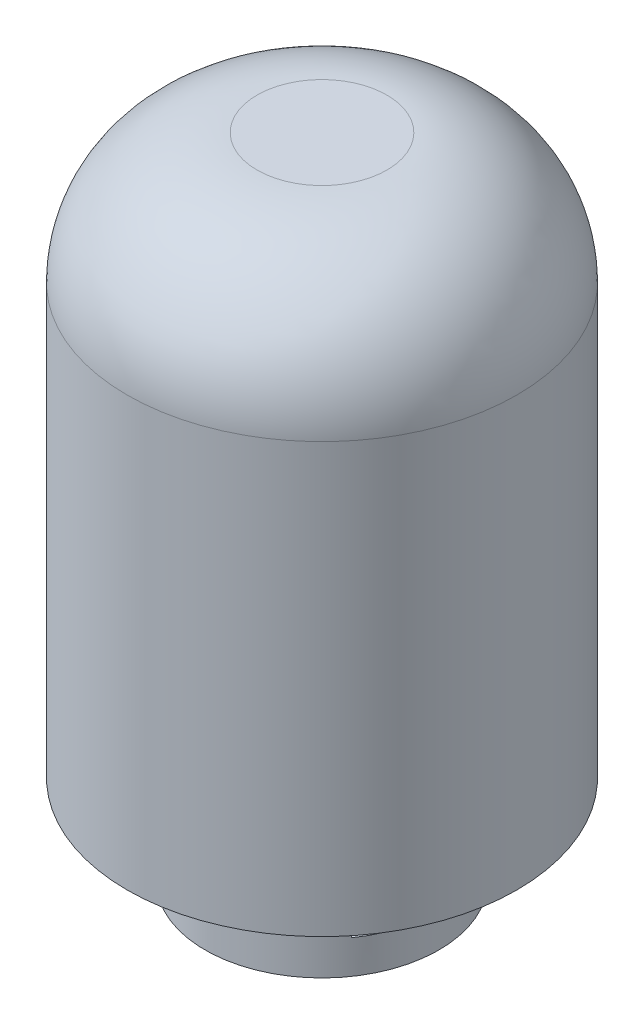
ISO-10303-21;
HEADER;
FILE_DESCRIPTION(('STEP AP214'),'2;1');
FILE_NAME('part.step','',(''),(''),'','','');
FILE_SCHEMA(('AUTOMOTIVE_DESIGN { 1 0 10303 214 1 1 1 1 }'));
ENDSEC;
DATA;
#1=APPLICATION_CONTEXT('core data for automotive mechanical design processes');
#2=APPLICATION_PROTOCOL_DEFINITION('international standard','automotive_design',2000,#1);
#3=PRODUCT_CONTEXT('',#1,'mechanical');
#4=PRODUCT('Part','Part','',(#3));
#5=PRODUCT_RELATED_PRODUCT_CATEGORY('part','',(#4));
#6=PRODUCT_DEFINITION_FORMATION('','',#4);
#7=PRODUCT_DEFINITION_CONTEXT('part definition',#1,'design');
#8=PRODUCT_DEFINITION('design','',#6,#7);
#9=PRODUCT_DEFINITION_SHAPE('','',#8);
#10=(LENGTH_UNIT() NAMED_UNIT(*) SI_UNIT(.MILLI.,.METRE.));
#11=(NAMED_UNIT(*) PLANE_ANGLE_UNIT() SI_UNIT($,.RADIAN.));
#12=(NAMED_UNIT(*) SI_UNIT($,.STERADIAN.) SOLID_ANGLE_UNIT());
#13=UNCERTAINTY_MEASURE_WITH_UNIT(LENGTH_MEASURE(1.E-05),#10,'distance_accuracy_value','');
#14=(GEOMETRIC_REPRESENTATION_CONTEXT(3) GLOBAL_UNCERTAINTY_ASSIGNED_CONTEXT((#13)) GLOBAL_UNIT_ASSIGNED_CONTEXT((#10,
#11,#12)) REPRESENTATION_CONTEXT('',''));
#15=CARTESIAN_POINT('',(0.,0.,0.));
#16=DIRECTION('',(0.,0.,1.));
#17=DIRECTION('',(1.,0.,0.));
#18=AXIS2_PLACEMENT_3D('',#15,#16,#17);
#19=CARTESIAN_POINT('',(0.,500.,0.));
#20=DIRECTION('',(0.,-1.,0.));
#21=DIRECTION('',(0.,0.,-1.));
#22=AXIS2_PLACEMENT_3D('',#19,#20,#21);
#23=CYLINDRICAL_SURFACE('',#22,150.);
#24=CARTESIAN_POINT('',(0.,316.930268713618,-150.));
#25=CARTESIAN_POINT('',(-0.897963726607649,316.930269795766,-150.000000723878));
#26=CARTESIAN_POINT('',(-1.79589933013839,316.912346694936,-149.991932593616));
#27=CARTESIAN_POINT('',(-3.59014286209545,316.840705533896,-149.959714425526));
#28=CARTESIAN_POINT('',(-4.48645064598536,316.786984437349,-149.935563023536));
#29=CARTESIAN_POINT('',(-6.27605289240073,316.643863674608,-149.871322350685));
#30=CARTESIAN_POINT('',(-7.16934576597934,316.554447485565,-149.831225698983));
#31=CARTESIAN_POINT('',(-8.95091468337228,316.340179646689,-149.735356554535));
#32=CARTESIAN_POINT('',(-9.83919021709062,316.215324457747,-149.679582496174));
#33=CARTESIAN_POINT('',(-11.6107680615418,315.930243235637,-149.552600420344));
#34=CARTESIAN_POINT('',(-12.4940568506258,315.769946869837,-149.481361718636));
#35=CARTESIAN_POINT('',(-14.2523487360671,315.414548283156,-149.323975898032));
#36=CARTESIAN_POINT('',(-15.1273509935033,315.219442577051,-149.237827286333));
#37=CARTESIAN_POINT('',(-16.8672537600114,314.794994017387,-149.051202459609));
#38=CARTESIAN_POINT('',(-17.7321566441733,314.565659395778,-148.95072968976));
#39=CARTESIAN_POINT('',(-19.450627125798,314.073306867624,-148.73608659745));
#40=CARTESIAN_POINT('',(-20.304193614517,313.810285692791,-148.621914945986));
#41=CARTESIAN_POINT('',(-22.8394744264702,312.973690049115,-148.260792899483));
#42=CARTESIAN_POINT('',(-24.5025345815619,312.350928334996,-147.994501252408));
#43=CARTESIAN_POINT('',(-27.7676202835299,310.979809985764,-147.416789849528));
#44=CARTESIAN_POINT('',(-29.3696439845671,310.231449556041,-147.105368730301));
#45=CARTESIAN_POINT('',(-32.5035395811796,308.615375237574,-146.444812937237));
#46=CARTESIAN_POINT('',(-34.0354331399172,307.747698541697,-146.095690022931));
#47=CARTESIAN_POINT('',(-37.0217568867908,305.899056462126,-145.36764514214));
#48=CARTESIAN_POINT('',(-38.4761848231274,304.918087787841,-144.988722310213));
#49=CARTESIAN_POINT('',(-41.3738503297023,302.795470226522,-144.189384794203));
#50=CARTESIAN_POINT('',(-42.8126094199402,301.64813165143,-143.767837625223));
#51=CARTESIAN_POINT('',(-45.5895556378162,299.242093676546,-142.911525449857));
#52=CARTESIAN_POINT('',(-46.9277396126281,297.9833907884,-142.476760029705));
#53=CARTESIAN_POINT('',(-49.4974997484848,295.360865951971,-141.60451921085));
#54=CARTESIAN_POINT('',(-50.7290144471632,293.996984244401,-141.167042403369));
#55=CARTESIAN_POINT('',(-53.0780430901764,291.171691880393,-140.30070851219));
#56=CARTESIAN_POINT('',(-54.1955533659693,289.710278087979,-139.87185170623));
#57=CARTESIAN_POINT('',(-56.3730859151129,286.607267425215,-139.009091790173));
#58=CARTESIAN_POINT('',(-57.4256982482058,284.960122385466,-138.576414691045));
#59=CARTESIAN_POINT('',(-59.387668496699,281.573432925948,-137.747014192213));
#60=CARTESIAN_POINT('',(-60.297019198132,279.833883859051,-137.350292603484));
#61=CARTESIAN_POINT('',(-61.54699999149,277.164413684057,-136.792450952378));
#62=CARTESIAN_POINT('',(-61.9446269710591,276.264636134097,-136.612722699818));
#63=CARTESIAN_POINT('',(-62.7010156148413,274.446299405818,-136.267221202872));
#64=CARTESIAN_POINT('',(-63.0597817740851,273.527742414358,-136.101446344992));
#65=CARTESIAN_POINT('',(-63.7374940943656,271.673390955956,-135.785388262023));
#66=CARTESIAN_POINT('',(-64.056438260829,270.737595628285,-135.63510581297));
#67=CARTESIAN_POINT('',(-64.6535195975648,268.850656541203,-135.351511472993));
#68=CARTESIAN_POINT('',(-64.9316620246984,267.899514776573,-135.218197396171));
#69=CARTESIAN_POINT('',(-65.4325886341979,266.034729903674,-134.976477575309));
#70=CARTESIAN_POINT('',(-65.657532990471,265.121789588703,-134.867123051159));
#71=CARTESIAN_POINT('',(-66.0693994136154,263.285579807978,-134.665834635669));
#72=CARTESIAN_POINT('',(-66.2563262152956,262.36231164361,-134.573898575084));
#73=CARTESIAN_POINT('',(-66.591613425137,260.507076928613,-134.408303315077));
#74=CARTESIAN_POINT('',(-66.7399701869683,259.575109564201,-134.334645843703));
#75=CARTESIAN_POINT('',(-66.997588166978,257.704588689166,-134.206348206611));
#76=CARTESIAN_POINT('',(-67.1068538224223,256.766035938395,-134.151705882485));
#77=CARTESIAN_POINT('',(-67.2858956350638,254.884688878571,-134.061994165164));
#78=CARTESIAN_POINT('',(-67.3556905933009,253.941896804908,-134.026915453362));
#79=CARTESIAN_POINT('',(-67.45562079938,252.053787474251,-133.976648553898));
#80=CARTESIAN_POINT('',(-67.4857604944271,251.108470512332,-133.961458135832));
#81=CARTESIAN_POINT('',(-67.5062877948071,249.217296820774,-133.951115101553));
#82=CARTESIAN_POINT('',(-67.4966753965906,248.271440091087,-133.95596248713));
#83=CARTESIAN_POINT('',(-67.4377322987871,246.381292694904,-133.985646114263));
#84=CARTESIAN_POINT('',(-67.3884024041979,245.437001997056,-134.010481950691));
#85=CARTESIAN_POINT('',(-67.2565926269489,243.639214447865,-134.076678087868));
#86=CARTESIAN_POINT('',(-67.1775994455162,242.785395278314,-134.116298249048));
#87=CARTESIAN_POINT('',(-66.9872672677983,241.082192478983,-134.211465017823));
#88=CARTESIAN_POINT('',(-66.8759256633904,240.232809212475,-134.267012909602));
#89=CARTESIAN_POINT('',(-66.6212252766361,238.540152678016,-134.39357350199));
#90=CARTESIAN_POINT('',(-66.4778718117158,237.696878419301,-134.464583634149));
#91=CARTESIAN_POINT('',(-66.1595305716245,236.017695334586,-134.621498296829));
#92=CARTESIAN_POINT('',(-65.984539820215,235.181787209313,-134.707404228624));
#93=CARTESIAN_POINT('',(-65.4127232296089,232.687051614057,-134.98650694043));
#94=CARTESIAN_POINT('',(-64.9690298856048,231.041059436436,-135.201100302112));
#95=CARTESIAN_POINT('',(-63.9611056062285,227.794233929143,-135.680829996122));
#96=CARTESIAN_POINT('',(-63.3968692943984,226.193402617344,-135.945968582812));
#97=CARTESIAN_POINT('',(-62.1385984318635,223.009831383483,-136.525766781468));
#98=CARTESIAN_POINT('',(-61.4419230989972,221.428314095816,-136.841408537975));
#99=CARTESIAN_POINT('',(-59.9329875859232,218.329507182064,-137.508971553331));
#100=CARTESIAN_POINT('',(-59.1207270253488,216.81221776736,-137.860892931567));
#101=CARTESIAN_POINT('',(-57.3857874417233,213.848377672659,-138.592054397057));
#102=CARTESIAN_POINT('',(-56.4630713256356,212.401850987122,-138.971303644406));
#103=CARTESIAN_POINT('',(-54.5128110025768,209.586366704599,-139.747826559225));
#104=CARTESIAN_POINT('',(-53.4852608450594,208.217413517675,-140.145101249137));
#105=CARTESIAN_POINT('',(-51.2226006070111,205.429902868654,-140.988811563049));
#106=CARTESIAN_POINT('',(-49.9770096586735,204.020120531546,-141.436184305927));
#107=CARTESIAN_POINT('',(-47.372330446627,201.309106731108,-142.329750896053));
#108=CARTESIAN_POINT('',(-46.0132352522987,200.007881906059,-142.775944669593));
#109=CARTESIAN_POINT('',(-43.1883420633296,197.521127334777,-143.655685225522));
#110=CARTESIAN_POINT('',(-41.7225103469433,196.335634431558,-144.089227949881));
#111=CARTESIAN_POINT('',(-38.6922863238986,194.088467807184,-144.932329163749));
#112=CARTESIAN_POINT('',(-37.127894055851,193.026794037524,-145.341887662654));
#113=CARTESIAN_POINT('',(-33.859013338828,191.004032883705,-146.138577524254));
#114=CARTESIAN_POINT('',(-32.1516809665461,190.047100706363,-146.524615242675));
#115=CARTESIAN_POINT('',(-28.6520480813877,188.281671057826,-147.248948125169));
#116=CARTESIAN_POINT('',(-26.8597447778378,187.473178466041,-147.587241719745));
#117=CARTESIAN_POINT('',(-23.2036262725102,186.013283170314,-148.206028792824));
#118=CARTESIAN_POINT('',(-21.339848871442,185.361798721683,-148.486552337598));
#119=CARTESIAN_POINT('',(-17.5542987287785,184.222889133297,-148.981505246283));
#120=CARTESIAN_POINT('',(-15.6325312539636,183.735449143256,-149.195940592747));
#121=CARTESIAN_POINT('',(-11.8856744291759,182.959403315176,-149.539339479824));
#122=CARTESIAN_POINT('',(-10.0634600965339,182.659099691548,-149.673306572311));
#123=CARTESIAN_POINT('',(-6.39692403183182,182.208692579835,-149.874779307781));
#124=CARTESIAN_POINT('',(-4.55260334888919,182.058581992263,-149.942288092184));
#125=CARTESIAN_POINT('',(-0.857191692920272,181.910391140358,-150.008931471916));
#126=CARTESIAN_POINT('',(0.993897079150536,181.912265205611,-150.008086607077));
#127=CARTESIAN_POINT('',(4.688344755231,182.067909945448,-149.938095445234));
#128=CARTESIAN_POINT('',(6.53170388620982,182.221676128139,-149.868951168044));
#129=CARTESIAN_POINT('',(10.0858923974315,182.665477066777,-149.670474398395));
#130=CARTESIAN_POINT('',(11.7980376313632,182.946782431901,-149.545001993502));
#131=CARTESIAN_POINT('',(15.190747005562,183.639020053861,-149.238540899741));
#132=CARTESIAN_POINT('',(16.8713127157462,184.049945848699,-149.057554978414));
#133=CARTESIAN_POINT('',(20.1902271040427,184.997486436991,-148.644380297984));
#134=CARTESIAN_POINT('',(21.8285729718467,185.534109573459,-148.412188140186));
#135=CARTESIAN_POINT('',(25.0532255016204,186.728256571894,-147.901998108013));
#136=CARTESIAN_POINT('',(26.6395301284072,187.385785155499,-147.623998444792));
#137=CARTESIAN_POINT('',(29.7997349840163,188.838655665072,-147.01919557636));
#138=CARTESIAN_POINT('',(31.3717183577973,189.637644813959,-146.69114437676));
#139=CARTESIAN_POINT('',(34.4426941044446,191.352357226966,-146.000610054867));
#140=CARTESIAN_POINT('',(35.941685585249,192.268081917262,-145.638126511924));
#141=CARTESIAN_POINT('',(38.8597822656825,194.210337679035,-144.886812879368));
#142=CARTESIAN_POINT('',(40.2788588908397,195.236908006661,-144.497973474056));
#143=CARTESIAN_POINT('',(43.0301890112443,197.394619552272,-143.702655494068));
#144=CARTESIAN_POINT('',(44.3624383388561,198.525765783517,-143.296176074245));
#145=CARTESIAN_POINT('',(46.3438420615755,200.344719435953,-142.663178975406));
#146=CARTESIAN_POINT('',(47.0260529765748,200.997923936694,-142.439626362712));
#147=CARTESIAN_POINT('',(48.3623048653516,202.332193266187,-141.991492167319));
#148=CARTESIAN_POINT('',(49.0163473852867,203.013256561763,-141.766910641848));
#149=CARTESIAN_POINT('',(50.2953320548644,204.402268279881,-141.318218474421));
#150=CARTESIAN_POINT('',(50.9202755863116,205.110215422902,-141.094107810591));
#151=CARTESIAN_POINT('',(52.1403353401983,206.552211499605,-140.647813946795));
#152=CARTESIAN_POINT('',(52.7354437453452,207.286267188918,-140.425631264473));
#153=CARTESIAN_POINT('',(54.4747477244499,209.526308353528,-139.764231450442));
#154=CARTESIAN_POINT('',(55.5728269528783,211.070064647618,-139.33019627561));
#155=CARTESIAN_POINT('',(57.638194031278,214.249567646676,-138.488566100045));
#156=CARTESIAN_POINT('',(58.6054876410052,215.8853102961,-138.080969935358));
#157=CARTESIAN_POINT('',(59.9643280513966,218.422490332448,-137.493749572727));
#158=CARTESIAN_POINT('',(60.4068739286565,219.293639536966,-137.299761850171));
#159=CARTESIAN_POINT('',(61.2545675561857,221.056269317313,-136.923675616138));
#160=CARTESIAN_POINT('',(61.6597242331188,221.947744976489,-136.741574269846));
#161=CARTESIAN_POINT('',(62.4317773214276,223.74984255163,-136.390809826209));
#162=CARTESIAN_POINT('',(62.798668666685,224.660466983657,-136.222148508945));
#163=CARTESIAN_POINT('',(63.4931854752843,226.499257270411,-135.899823366523));
#164=CARTESIAN_POINT('',(63.8208085599187,227.42742418385,-135.74616045001));
#165=CARTESIAN_POINT('',(64.4355559061496,229.298745149595,-135.455434261356));
#166=CARTESIAN_POINT('',(64.7227145504092,230.241885711181,-135.318356910622));
#167=CARTESIAN_POINT('',(65.2559783363071,232.142092181728,-135.062003684358));
#168=CARTESIAN_POINT('',(65.5020838428868,233.09915796682,-134.942727650586));
#169=CARTESIAN_POINT('',(65.9524149407127,235.025167111293,-134.723204106741));
#170=CARTESIAN_POINT('',(66.1566442473793,235.994109408853,-134.622954908593));
#171=CARTESIAN_POINT('',(66.5225375959131,237.941847672936,-134.442529138317));
#172=CARTESIAN_POINT('',(66.6842024294823,238.920643455832,-134.362352192846));
#173=CARTESIAN_POINT('',(66.9522914215903,240.801063385391,-134.228950166749));
#174=CARTESIAN_POINT('',(67.0622784682132,241.702058860108,-134.173996442363));
#175=CARTESIAN_POINT('',(67.2458927141366,243.508747666731,-134.082066217295));
#176=CARTESIAN_POINT('',(67.3195168269408,244.414441390836,-134.045091242658));
#177=CARTESIAN_POINT('',(67.4301433220394,246.228487518599,-133.989475726113));
#178=CARTESIAN_POINT('',(67.4671512214819,247.136839501031,-133.970832422083));
#179=CARTESIAN_POINT('',(67.5044458123005,248.954583598673,-133.95204452977));
#180=CARTESIAN_POINT('',(67.5047286870166,249.863975812167,-133.951901864173));
#181=CARTESIAN_POINT('',(67.4685677849198,251.681564330601,-133.970118954381));
#182=CARTESIAN_POINT('',(67.4321353105869,252.589760917451,-133.988473016142));
#183=CARTESIAN_POINT('',(67.3226756466116,254.403483556528,-134.043504411724));
#184=CARTESIAN_POINT('',(67.2496444350346,255.309009304246,-134.080183759359));
#185=CARTESIAN_POINT('',(67.0672272380783,257.115376544049,-134.171522637401));
#186=CARTESIAN_POINT('',(66.9578458319716,258.016218611657,-134.226179903003));
#187=CARTESIAN_POINT('',(66.703078959618,259.811584931893,-134.352965199176));
#188=CARTESIAN_POINT('',(66.5576900746341,260.706108576317,-134.425094888656));
#189=CARTESIAN_POINT('',(66.0888377908106,263.264618615233,-134.656538486536));
#190=CARTESIAN_POINT('',(65.720704380696,264.918771403542,-134.837000296733));
#191=CARTESIAN_POINT('',(64.8633227387922,268.188106866461,-135.251525674699));
#192=CARTESIAN_POINT('',(64.3740810195719,269.803291631443,-135.48558636015));
#193=CARTESIAN_POINT('',(63.2787523533876,272.986212683961,-136.000608743335));
#194=CARTESIAN_POINT('',(62.6726408667253,274.553938926277,-136.2815802895));
#195=CARTESIAN_POINT('',(61.3484661239855,277.633561857841,-136.882775036709));
#196=CARTESIAN_POINT('',(60.6303964251673,279.145455327942,-137.20300049643));
#197=CARTESIAN_POINT('',(59.0373511644317,282.202215465167,-137.896314512877));
#198=CARTESIAN_POINT('',(58.1552301290423,283.742887672746,-138.271482742328));
#199=CARTESIAN_POINT('',(56.2757409548518,286.745527405748,-139.047021611039));
#200=CARTESIAN_POINT('',(55.2783691836601,288.207492448404,-139.447393044454));
#201=CARTESIAN_POINT('',(53.1738885464206,291.046501140557,-140.26336433395));
#202=CARTESIAN_POINT('',(52.0667404313626,292.423514129099,-140.678969602957));
#203=CARTESIAN_POINT('',(49.7488092103536,295.085733673349,-141.515278834471));
#204=CARTESIAN_POINT('',(48.538021566688,296.370936204739,-141.935983019535));
#205=CARTESIAN_POINT('',(45.90428210018,298.955537186503,-142.810686184948));
#206=CARTESIAN_POINT('',(44.4720475425898,300.245649802218,-143.264243947156));
#207=CARTESIAN_POINT('',(41.499135589937,302.70117716844,-144.153493276684));
#208=CARTESIAN_POINT('',(39.958450422456,303.866582966366,-144.589183559932));
#209=CARTESIAN_POINT('',(36.7761221118317,306.065127035369,-145.431169823165));
#210=CARTESIAN_POINT('',(35.1344259941897,307.098195012305,-145.837450131978));
#211=CARTESIAN_POINT('',(32.6047610607029,308.541376599887,-146.416117172184));
#212=CARTESIAN_POINT('',(31.7502537034712,309.004746082768,-146.603899817912));
#213=CARTESIAN_POINT('',(30.0200995828513,309.895049318554,-146.967937140262));
#214=CARTESIAN_POINT('',(29.1444551440738,310.321987054934,-147.14419307673));
#215=CARTESIAN_POINT('',(27.3821613046653,311.134397457036,-147.482251270428));
#216=CARTESIAN_POINT('',(26.4957045290518,311.52023627492,-147.64417851113));
#217=CARTESIAN_POINT('',(24.7050646921198,312.254196420953,-147.954335069683));
#218=CARTESIAN_POINT('',(23.8008836391933,312.60232199366,-148.10256592876));
#219=CARTESIAN_POINT('',(21.9760677843861,313.260068642263,-148.384315262346));
#220=CARTESIAN_POINT('',(21.0554284168612,313.569678838052,-148.51782957841));
#221=CARTESIAN_POINT('',(19.1997802043503,314.149378598065,-148.769099463014));
#222=CARTESIAN_POINT('',(18.2647730254487,314.419472706907,-148.886856843576));
#223=CARTESIAN_POINT('',(16.3845592224588,314.918740133088,-149.105464837381));
#224=CARTESIAN_POINT('',(15.4393852108856,315.148017423271,-149.206358366676));
#225=CARTESIAN_POINT('',(13.5385040229127,315.565779105036,-149.390831733259));
#226=CARTESIAN_POINT('',(12.582798135125,315.754268430189,-149.474413664446));
#227=CARTESIAN_POINT('',(10.6632791126675,316.089801409218,-149.623596848567));
#228=CARTESIAN_POINT('',(9.69947055683029,316.23686703755,-149.689207634328));
#229=CARTESIAN_POINT('',(7.76545303396319,316.48918665149,-149.801988303138));
#230=CARTESIAN_POINT('',(6.79524523138477,316.59444804172,-149.84916145195));
#231=CARTESIAN_POINT('',(5.33906633450358,316.720537855048,-149.905733667944));
#232=CARTESIAN_POINT('',(4.85468623533461,316.75721745096,-149.922203944106));
#233=CARTESIAN_POINT('',(3.8852164137705,316.82011218012,-149.950459200925));
#234=CARTESIAN_POINT('',(3.40012686726992,316.846329572171,-149.962245192923));
#235=CARTESIAN_POINT('',(1.94393152818722,316.909266869021,-149.990545175388));
#236=CARTESIAN_POINT('',(0.971949289964499,316.930267542309,-149.99999921648));
#237=CARTESIAN_POINT('',(0.,316.930268713618,-150.));
#238=B_SPLINE_CURVE_WITH_KNOTS('',3,(#24,#25,#26,#27,#28,#29,#30,#31,#32,#33,#34,#35,#36,#37,
#38,#39,#40,#41,#42,#43,#44,#45,#46,#47,#48,#49,#50,#51,#52,#53,#54,#55,#56,#57,#58,#59,#60,#61,
#62,#63,#64,#65,#66,#67,#68,#69,#70,#71,#72,#73,#74,#75,#76,#77,#78,#79,#80,#81,#82,#83,#84,#85,
#86,#87,#88,#89,#90,#91,#92,#93,#94,#95,#96,#97,#98,#99,#100,#101,#102,#103,#104,#105,#106,#107,
#108,#109,#110,#111,#112,#113,#114,#115,#116,#117,#118,#119,#120,#121,#122,#123,#124,#125,#126,
#127,#128,#129,#130,#131,#132,#133,#134,#135,#136,#137,#138,#139,#140,#141,#142,#143,#144,#145,
#146,#147,#148,#149,#150,#151,#152,#153,#154,#155,#156,#157,#158,#159,#160,#161,#162,#163,#164,
#165,#166,#167,#168,#169,#170,#171,#172,#173,#174,#175,#176,#177,#178,#179,#180,#181,#182,#183,
#184,#185,#186,#187,#188,#189,#190,#191,#192,#193,#194,#195,#196,#197,#198,#199,#200,#201,#202,
#203,#204,#205,#206,#207,#208,#209,#210,#211,#212,#213,#214,#215,#216,#217,#218,#219,#220,#221,
#222,#223,#224,#225,#226,#227,#228,#229,#230,#231,#232,#233,#234,#235,#236,#237),.UNSPECIFIED.,
.T.,.F.,(4,2,2,2,2,2,2,2,2,2,2,2,2,2,2,2,2,2,2,2,2,2,2,2,2,2,2,2,2,2,2,2,2,2,2,2,2,2,2,2,2,2,2,
2,2,2,2,2,2,2,2,2,2,2,2,2,2,2,2,2,2,2,2,2,2,2,2,2,2,2,2,2,2,2,2,2,2,2,2,2,2,2,2,2,2,2,2,2,2,2,2,
2,2,2,2,2,2,2,2,2,2,2,2,2,2,2,4),(0.,2.69362771412853,5.38748392727439,8.08258854417227,
10.7779624018336,13.4787339918743,16.1797761438385,18.880169747077,21.5808255427617,
26.9611957639068,32.3417285670319,37.7205879544263,43.0996036112732,48.7571272998421,
54.4148282664114,60.0757677851801,65.7368894095756,71.7358316918534,77.7350759555437,
80.734244810017,83.7330663793704,86.7320380911846,89.7306230780508,92.5694124667648,
95.4078480881904,98.2465519518212,101.084933489376,103.921961882109,106.758672084468,
109.595382540111,112.432035502483,115.006415599724,117.58100331646,120.155163691273,
122.729566353163,127.877906118852,133.026475558764,138.291182119314,143.555906005306,
148.822402869969,154.089198835833,159.883754206329,165.678663653984,171.47541192384,
177.272157922849,183.24918650544,189.226411525871,195.2005178094,201.174083135499,
206.721783860401,212.269222338239,217.814993852574,223.360601367145,228.573482532406,
233.786103859728,238.999071266776,244.212242295522,249.58739215288,254.962607685528,
260.339733141578,265.717116505232,268.628230447614,271.539184395337,274.449999971224,
277.361574284675,283.185154773319,289.008478709794,291.996200575901,294.983207268522,
297.970608923639,300.958191451727,303.943219920656,306.928221852789,309.912958829155,
312.897640285279,315.624782226299,318.352155608151,321.079117980397,323.806363752856,
326.532770224355,329.259476373784,331.985839152272,334.712460885098,339.818845759307,
344.92495609858,350.032139761863,355.139617431382,360.577514467698,366.015582938553,
371.455602774911,376.895860917031,382.829567834739,388.763700442083,394.700972138453,
397.67026953614,400.639241851439,403.579046669826,406.518520273793,409.45882236519,
412.398786035665,415.331150091509,418.263159260281,421.193610113961,424.123541676475,
425.581562339922,427.039268044406,429.954830740983),.UNSPECIFIED.);
#239=CARTESIAN_POINT('',(0.,316.930268713618,-150.));
#240=VERTEX_POINT('',#239);
#241=EDGE_CURVE('E11',#240,#240,#238,.T.);
#242=ORIENTED_EDGE('',*,*,#241,.T.);
#243=EDGE_LOOP('',(#242));
#244=FACE_BOUND('',#243,.T.);
#245=CARTESIAN_POINT('',(0.,400.,0.));
#246=DIRECTION('',(0.,1.,0.));
#247=DIRECTION('',(0.,0.,1.));
#248=AXIS2_PLACEMENT_3D('',#245,#246,#247);
#249=CIRCLE('',#248,150.);
#250=CARTESIAN_POINT('',(0.,400.,150.));
#251=VERTEX_POINT('',#250);
#252=EDGE_CURVE('E48',#251,#251,#249,.F.);
#253=ORIENTED_EDGE('',*,*,#252,.T.);
#254=EDGE_LOOP('',(#253));
#255=FACE_BOUND('',#254,.T.);
#256=CARTESIAN_POINT('',(0.,70.,0.));
#257=DIRECTION('',(0.,-1.,0.));
#258=DIRECTION('',(0.,0.,-1.));
#259=AXIS2_PLACEMENT_3D('',#256,#257,#258);
#260=CIRCLE('',#259,150.);
#261=CARTESIAN_POINT('',(0.,70.,-150.));
#262=VERTEX_POINT('',#261);
#263=EDGE_CURVE('E84',#262,#262,#260,.T.);
#264=ORIENTED_EDGE('',*,*,#263,.F.);
#265=EDGE_LOOP('',(#264));
#266=FACE_BOUND('',#265,.T.);
#267=ADVANCED_FACE('F36',(#244,#255,#266),#23,.T.);
#268=CARTESIAN_POINT('',(0.,500.,0.));
#269=DIRECTION('',(0.,1.,0.));
#270=DIRECTION('',(0.,0.,1.));
#271=AXIS2_PLACEMENT_3D('',#268,#269,#270);
#272=PLANE('',#271);
#273=CARTESIAN_POINT('',(0.,500.,0.));
#274=DIRECTION('',(0.,1.,0.));
#275=DIRECTION('',(0.,0.,1.));
#276=AXIS2_PLACEMENT_3D('',#273,#274,#275);
#277=CIRCLE('',#276,50.);
#278=CARTESIAN_POINT('',(0.,500.,50.));
#279=VERTEX_POINT('',#278);
#280=EDGE_CURVE('E110',#279,#279,#277,.T.);
#281=ORIENTED_EDGE('',*,*,#280,.T.);
#282=EDGE_LOOP('',(#281));
#283=FACE_BOUND('',#282,.T.);
#284=ADVANCED_FACE('F122',(#283),#272,.T.);
#285=CARTESIAN_POINT('',(0.,70.,0.));
#286=DIRECTION('',(0.,-1.,0.));
#287=DIRECTION('',(0.,0.,-1.));
#288=AXIS2_PLACEMENT_3D('',#285,#286,#287);
#289=PLANE('',#288);
#290=CARTESIAN_POINT('',(0.,70.,0.));
#291=DIRECTION('',(0.,-1.,0.));
#292=DIRECTION('',(0.,0.,-1.));
#293=AXIS2_PLACEMENT_3D('',#290,#291,#292);
#294=CIRCLE('',#293,90.0000000000001);
#295=CARTESIAN_POINT('',(0.,70.,-90.0000000000001));
#296=VERTEX_POINT('',#295);
#297=EDGE_CURVE('E152',#296,#296,#294,.T.);
#298=ORIENTED_EDGE('',*,*,#297,.F.);
#299=EDGE_LOOP('',(#298));
#300=FACE_BOUND('',#299,.T.);
#301=ORIENTED_EDGE('',*,*,#263,.T.);
#302=EDGE_LOOP('',(#301));
#303=FACE_BOUND('',#302,.T.);
#304=ADVANCED_FACE('F124',(#300,#303),#289,.T.);
#305=CARTESIAN_POINT('',(0.,70.,0.));
#306=DIRECTION('',(0.,-1.,0.));
#307=DIRECTION('',(0.,0.,-1.));
#308=AXIS2_PLACEMENT_3D('',#305,#306,#307);
#309=CYLINDRICAL_SURFACE('',#308,90.0000000000001);
#310=DIRECTION('',(0.,-1.,0.));
#311=VECTOR('',#310,1.);
#312=CARTESIAN_POINT('',(-73.9996569842072,70.,-51.2254894190352));
#313=LINE('',#312,#311);
#314=CARTESIAN_POINT('',(-73.9996569842072,44.1831684542477,-51.2254894190352));
#315=VERTEX_POINT('',#314);
#316=CARTESIAN_POINT('',(-73.9996569842072,25.8168315457523,-51.2254894190352));
#317=VERTEX_POINT('',#316);
#318=EDGE_CURVE('E108',#315,#317,#313,.T.);
#319=ORIENTED_EDGE('',*,*,#318,.F.);
#320=CARTESIAN_POINT('',(0.,44.1831684542477,0.));
#321=DIRECTION('',(0.,1.,0.));
#322=DIRECTION('',(0.,0.,1.));
#323=AXIS2_PLACEMENT_3D('',#320,#321,#322);
#324=CIRCLE('',#323,90.0000000000001);
#325=CARTESIAN_POINT('',(-73.9996569842072,44.1831684542477,51.2254894190352));
#326=VERTEX_POINT('',#325);
#327=EDGE_CURVE('E86',#326,#315,#324,.F.);
#328=ORIENTED_EDGE('',*,*,#327,.F.);
#329=DIRECTION('',(0.,-1.,0.));
#330=VECTOR('',#329,1.);
#331=CARTESIAN_POINT('',(-73.9996569842072,70.,51.2254894190352));
#332=LINE('',#331,#330);
#333=CARTESIAN_POINT('',(-73.9996569842072,25.8168315457523,51.2254894190352));
#334=VERTEX_POINT('',#333);
#335=EDGE_CURVE('E92',#334,#326,#332,.F.);
#336=ORIENTED_EDGE('',*,*,#335,.F.);
#337=CARTESIAN_POINT('',(0.,25.8168315457523,0.));
#338=DIRECTION('',(0.,-1.,0.));
#339=DIRECTION('',(0.,0.,-1.));
#340=AXIS2_PLACEMENT_3D('',#337,#338,#339);
#341=CIRCLE('',#340,90.0000000000001);
#342=EDGE_CURVE('E103',#317,#334,#341,.F.);
#343=ORIENTED_EDGE('',*,*,#342,.F.);
#344=EDGE_LOOP('',(#319,#328,#336,#343));
#345=FACE_BOUND('',#344,.T.);
#346=DIRECTION('',(0.,-1.,0.));
#347=VECTOR('',#346,1.);
#348=CARTESIAN_POINT('',(73.9996569842072,70.,-51.2254894190352));
#349=LINE('',#348,#347);
#350=CARTESIAN_POINT('',(73.9996569842072,25.8168315457523,-51.2254894190352));
#351=VERTEX_POINT('',#350);
#352=CARTESIAN_POINT('',(73.9996569842072,44.1831684542477,-51.2254894190352));
#353=VERTEX_POINT('',#352);
#354=EDGE_CURVE('E101',#351,#353,#349,.F.);
#355=ORIENTED_EDGE('',*,*,#354,.F.);
#356=CARTESIAN_POINT('',(73.9996569842072,25.8168315457523,51.2254894190352));
#357=VERTEX_POINT('',#356);
#358=EDGE_CURVE('E99',#357,#351,#341,.F.);
#359=ORIENTED_EDGE('',*,*,#358,.F.);
#360=DIRECTION('',(0.,-1.,0.));
#361=VECTOR('',#360,1.);
#362=CARTESIAN_POINT('',(73.9996569842072,70.,51.2254894190352));
#363=LINE('',#362,#361);
#364=CARTESIAN_POINT('',(73.9996569842072,44.1831684542477,51.2254894190352));
#365=VERTEX_POINT('',#364);
#366=EDGE_CURVE('E83',#365,#357,#363,.T.);
#367=ORIENTED_EDGE('',*,*,#366,.F.);
#368=EDGE_CURVE('E78',#353,#365,#324,.F.);
#369=ORIENTED_EDGE('',*,*,#368,.F.);
#370=EDGE_LOOP('',(#355,#359,#367,#369));
#371=FACE_BOUND('',#370,.T.);
#372=ORIENTED_EDGE('',*,*,#297,.T.);
#373=EDGE_LOOP('',(#372));
#374=FACE_BOUND('',#373,.T.);
#375=CARTESIAN_POINT('',(0.,0.,0.));
#376=DIRECTION('',(0.,-1.,0.));
#377=DIRECTION('',(0.,0.,-1.));
#378=AXIS2_PLACEMENT_3D('',#375,#376,#377);
#379=CIRCLE('',#378,90.0000000000001);
#380=CARTESIAN_POINT('',(0.,0.,-90.0000000000001));
#381=VERTEX_POINT('',#380);
#382=EDGE_CURVE('E150',#381,#381,#379,.T.);
#383=ORIENTED_EDGE('',*,*,#382,.F.);
#384=EDGE_LOOP('',(#383));
#385=FACE_BOUND('',#384,.T.);
#386=ADVANCED_FACE('F97',(#345,#371,#374,#385),#309,.T.);
#387=CARTESIAN_POINT('',(0.,0.,0.));
#388=DIRECTION('',(0.,1.,0.));
#389=DIRECTION('',(0.,0.,1.));
#390=AXIS2_PLACEMENT_3D('',#387,#388,#389);
#391=PLANE('',#390);
#392=ORIENTED_EDGE('',*,*,#382,.T.);
#393=EDGE_LOOP('',(#392));
#394=FACE_BOUND('',#393,.T.);
#395=ADVANCED_FACE('F135',(#394),#391,.F.);
#396=CARTESIAN_POINT('',(-150.,44.1831684542477,-51.2254894190352));
#397=DIRECTION('',(0.,0.,-1.));
#398=DIRECTION('',(-1.,0.,0.));
#399=AXIS2_PLACEMENT_3D('',#396,#397,#398);
#400=PLANE('',#399);
#401=ORIENTED_EDGE('',*,*,#354,.T.);
#402=DIRECTION('',(1.,0.,0.));
#403=VECTOR('',#402,1.);
#404=CARTESIAN_POINT('',(-150.,44.1831684542477,-51.2254894190352));
#405=LINE('',#404,#403);
#406=EDGE_CURVE('E60',#315,#353,#405,.T.);
#407=ORIENTED_EDGE('',*,*,#406,.F.);
#408=ORIENTED_EDGE('',*,*,#318,.T.);
#409=DIRECTION('',(1.,0.,0.));
#410=VECTOR('',#409,1.);
#411=CARTESIAN_POINT('',(-150.,25.8168315457523,-51.2254894190352));
#412=LINE('',#411,#410);
#413=EDGE_CURVE('E153',#317,#351,#412,.T.);
#414=ORIENTED_EDGE('',*,*,#413,.T.);
#415=EDGE_LOOP('',(#401,#407,#408,#414));
#416=FACE_BOUND('',#415,.T.);
#417=ADVANCED_FACE('F137',(#416),#400,.F.);
#418=CARTESIAN_POINT('',(-150.,25.8168315457523,51.2254894190352));
#419=DIRECTION('',(0.,-1.,0.));
#420=DIRECTION('',(0.,0.,-1.));
#421=AXIS2_PLACEMENT_3D('',#418,#419,#420);
#422=PLANE('',#421);
#423=ORIENTED_EDGE('',*,*,#342,.T.);
#424=DIRECTION('',(1.,0.,0.));
#425=VECTOR('',#424,1.);
#426=CARTESIAN_POINT('',(-150.,25.8168315457523,51.2254894190352));
#427=LINE('',#426,#425);
#428=EDGE_CURVE('E94',#334,#357,#427,.T.);
#429=ORIENTED_EDGE('',*,*,#428,.T.);
#430=ORIENTED_EDGE('',*,*,#358,.T.);
#431=ORIENTED_EDGE('',*,*,#413,.F.);
#432=EDGE_LOOP('',(#423,#429,#430,#431));
#433=FACE_BOUND('',#432,.T.);
#434=ADVANCED_FACE('F144',(#433),#422,.F.);
#435=CARTESIAN_POINT('',(-150.,44.1831684542477,51.2254894190352));
#436=DIRECTION('',(0.,0.,1.));
#437=DIRECTION('',(1.,0.,0.));
#438=AXIS2_PLACEMENT_3D('',#435,#436,#437);
#439=PLANE('',#438);
#440=ORIENTED_EDGE('',*,*,#335,.T.);
#441=DIRECTION('',(1.,0.,0.));
#442=VECTOR('',#441,1.);
#443=CARTESIAN_POINT('',(-150.,44.1831684542477,51.2254894190352));
#444=LINE('',#443,#442);
#445=EDGE_CURVE('E55',#326,#365,#444,.T.);
#446=ORIENTED_EDGE('',*,*,#445,.T.);
#447=ORIENTED_EDGE('',*,*,#366,.T.);
#448=ORIENTED_EDGE('',*,*,#428,.F.);
#449=EDGE_LOOP('',(#440,#446,#447,#448));
#450=FACE_BOUND('',#449,.T.);
#451=ADVANCED_FACE('F88',(#450),#439,.F.);
#452=CARTESIAN_POINT('',(-150.,44.1831684542477,51.2254894190352));
#453=DIRECTION('',(0.,1.,0.));
#454=DIRECTION('',(0.,0.,1.));
#455=AXIS2_PLACEMENT_3D('',#452,#453,#454);
#456=PLANE('',#455);
#457=ORIENTED_EDGE('',*,*,#327,.T.);
#458=ORIENTED_EDGE('',*,*,#406,.T.);
#459=ORIENTED_EDGE('',*,*,#368,.T.);
#460=ORIENTED_EDGE('',*,*,#445,.F.);
#461=EDGE_LOOP('',(#457,#458,#459,#460));
#462=FACE_BOUND('',#461,.T.);
#463=ADVANCED_FACE('F79',(#462),#456,.F.);
#464=CARTESIAN_POINT('',(0.,400.,0.));
#465=DIRECTION('',(0.,1.,0.));
#466=DIRECTION('',(0.,0.,1.));
#467=AXIS2_PLACEMENT_3D('',#464,#465,#466);
#468=DEGENERATE_TOROIDAL_SURFACE('',#467,50.,100.,.T.);
#469=ORIENTED_EDGE('',*,*,#252,.F.);
#470=EDGE_LOOP('',(#469));
#471=FACE_BOUND('',#470,.T.);
#472=ORIENTED_EDGE('',*,*,#280,.F.);
#473=EDGE_LOOP('',(#472));
#474=FACE_BOUND('',#473,.T.);
#475=ADVANCED_FACE('F38',(#471,#474),#468,.T.);
#476=CARTESIAN_POINT('',(0.,249.430268713618,-150.));
#477=DIRECTION('',(0.,0.,1.));
#478=DIRECTION('',(1.,0.,0.));
#479=AXIS2_PLACEMENT_3D('',#476,#477,#478);
#480=CYLINDRICAL_SURFACE('',#479,67.5);
#481=CARTESIAN_POINT('',(0.,249.430268713618,0.));
#482=DIRECTION('',(0.,0.,1.));
#483=DIRECTION('',(1.,0.,0.));
#484=AXIS2_PLACEMENT_3D('',#481,#482,#483);
#485=CIRCLE('',#484,67.5);
#486=CARTESIAN_POINT('',(67.5,249.430268713618,0.));
#487=VERTEX_POINT('',#486);
#488=EDGE_CURVE('E163',#487,#487,#485,.T.);
#489=ORIENTED_EDGE('',*,*,#488,.T.);
#490=EDGE_LOOP('',(#489));
#491=FACE_BOUND('',#490,.T.);
#492=ORIENTED_EDGE('',*,*,#241,.F.);
#493=EDGE_LOOP('',(#492));
#494=FACE_BOUND('',#493,.T.);
#495=ADVANCED_FACE('F119',(#491,#494),#480,.F.);
#496=CARTESIAN_POINT('',(0.,249.430268713618,0.));
#497=DIRECTION('',(0.,0.,1.));
#498=DIRECTION('',(1.,0.,0.));
#499=AXIS2_PLACEMENT_3D('',#496,#497,#498);
#500=PLANE('',#499);
#501=ORIENTED_EDGE('',*,*,#488,.F.);
#502=EDGE_LOOP('',(#501));
#503=FACE_BOUND('',#502,.T.);
#504=ADVANCED_FACE('F171',(#503),#500,.F.);
#505=CLOSED_SHELL('',(#267,#284,#304,#386,#395,#417,#434,#451,#463,#475,#495,#504));
#506=MANIFOLD_SOLID_BREP('B2',#505);
#507=ADVANCED_BREP_SHAPE_REPRESENTATION('',(#18,#506),#14);
#508=SHAPE_DEFINITION_REPRESENTATION(#9,#507);
ENDSEC;
END-ISO-10303-21;
